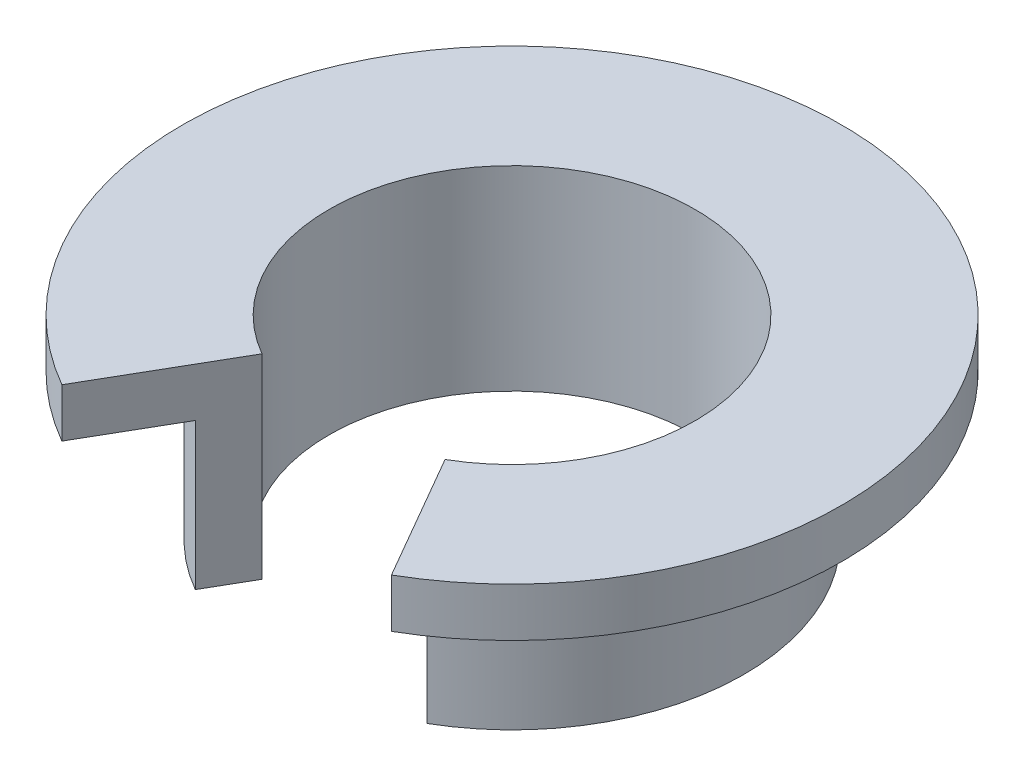
ISO-10303-21;
HEADER;
FILE_DESCRIPTION(('STEP AP214'),'2;1');
FILE_NAME('part.step','',(''),(''),'','','');
FILE_SCHEMA(('AUTOMOTIVE_DESIGN { 1 0 10303 214 1 1 1 1 }'));
ENDSEC;
DATA;
#1=APPLICATION_CONTEXT('core data for automotive mechanical design processes');
#2=APPLICATION_PROTOCOL_DEFINITION('international standard','automotive_design',2000,#1);
#3=PRODUCT_CONTEXT('',#1,'mechanical');
#4=PRODUCT('Part','Part','',(#3));
#5=PRODUCT_RELATED_PRODUCT_CATEGORY('part','',(#4));
#6=PRODUCT_DEFINITION_FORMATION('','',#4);
#7=PRODUCT_DEFINITION_CONTEXT('part definition',#1,'design');
#8=PRODUCT_DEFINITION('design','',#6,#7);
#9=PRODUCT_DEFINITION_SHAPE('','',#8);
#10=(LENGTH_UNIT() NAMED_UNIT(*) SI_UNIT(.MILLI.,.METRE.));
#11=(NAMED_UNIT(*) PLANE_ANGLE_UNIT() SI_UNIT($,.RADIAN.));
#12=(NAMED_UNIT(*) SI_UNIT($,.STERADIAN.) SOLID_ANGLE_UNIT());
#13=UNCERTAINTY_MEASURE_WITH_UNIT(LENGTH_MEASURE(1.E-05),#10,'distance_accuracy_value','');
#14=(GEOMETRIC_REPRESENTATION_CONTEXT(3) GLOBAL_UNCERTAINTY_ASSIGNED_CONTEXT((#13)) GLOBAL_UNIT_ASSIGNED_CONTEXT((#10,
#11,#12)) REPRESENTATION_CONTEXT('',''));
#15=CARTESIAN_POINT('',(0.,0.,0.));
#16=DIRECTION('',(0.,0.,1.));
#17=DIRECTION('',(1.,0.,0.));
#18=AXIS2_PLACEMENT_3D('',#15,#16,#17);
#19=CARTESIAN_POINT('',(4.75,0.,0.));
#20=DIRECTION('',(0.,-1.,0.));
#21=DIRECTION('',(0.,0.,-1.));
#22=AXIS2_PLACEMENT_3D('',#19,#20,#21);
#23=PLANE('',#22);
#24=CARTESIAN_POINT('',(0.,0.,0.));
#25=DIRECTION('',(0.,-1.,0.));
#26=DIRECTION('',(0.,0.,-1.));
#27=AXIS2_PLACEMENT_3D('',#24,#25,#26);
#28=CIRCLE('',#27,4.75);
#29=CARTESIAN_POINT('',(-2.37499999999997,0.,4.1136206679761));
#30=VERTEX_POINT('',#29);
#31=CARTESIAN_POINT('',(2.37500000000001,0.,4.11362066797608));
#32=VERTEX_POINT('',#31);
#33=EDGE_CURVE('E90',#30,#32,#28,.T.);
#34=ORIENTED_EDGE('',*,*,#33,.T.);
#35=DIRECTION('',(-0.500000000000001,0.,-0.866025403784438));
#36=VECTOR('',#35,1.);
#37=CARTESIAN_POINT('',(0.,0.,0.));
#38=LINE('',#37,#36);
#39=CARTESIAN_POINT('',(1.875,0.,3.24759526419164));
#40=VERTEX_POINT('',#39);
#41=EDGE_CURVE('E47',#32,#40,#38,.T.);
#42=ORIENTED_EDGE('',*,*,#41,.T.);
#43=CARTESIAN_POINT('',(0.,0.,0.));
#44=DIRECTION('',(0.,-1.,0.));
#45=DIRECTION('',(0.,0.,-1.));
#46=AXIS2_PLACEMENT_3D('',#43,#44,#45);
#47=CIRCLE('',#46,3.75);
#48=CARTESIAN_POINT('',(-1.87499999999998,0.,3.24759526419166));
#49=VERTEX_POINT('',#48);
#50=EDGE_CURVE('E96',#49,#40,#47,.T.);
#51=ORIENTED_EDGE('',*,*,#50,.F.);
#52=DIRECTION('',(-0.499999999999995,0.,0.866025403784442));
#53=VECTOR('',#52,1.);
#54=CARTESIAN_POINT('',(-4.54558343328374,0.,7.87318145649093));
#55=LINE('',#54,#53);
#56=EDGE_CURVE('E98',#49,#30,#55,.T.);
#57=ORIENTED_EDGE('',*,*,#56,.T.);
#58=EDGE_LOOP('',(#34,#42,#51,#57));
#59=FACE_BOUND('',#58,.T.);
#60=ADVANCED_FACE('F33',(#59),#23,.T.);
#61=CARTESIAN_POINT('',(0.,0.,0.));
#62=DIRECTION('',(0.,-1.,0.));
#63=DIRECTION('',(0.,0.,-1.));
#64=AXIS2_PLACEMENT_3D('',#61,#62,#63);
#65=CYLINDRICAL_SURFACE('',#64,3.75);
#66=ORIENTED_EDGE('',*,*,#50,.T.);
#67=DIRECTION('',(0.,-1.,0.));
#68=VECTOR('',#67,1.);
#69=CARTESIAN_POINT('',(1.875,0.,3.24759526419164));
#70=LINE('',#69,#68);
#71=CARTESIAN_POINT('',(1.875,4.,3.24759526419164));
#72=VERTEX_POINT('',#71);
#73=EDGE_CURVE('E82',#40,#72,#70,.F.);
#74=ORIENTED_EDGE('',*,*,#73,.T.);
#75=CARTESIAN_POINT('',(0.,4.,0.));
#76=DIRECTION('',(0.,-1.,0.));
#77=DIRECTION('',(0.,0.,-1.));
#78=AXIS2_PLACEMENT_3D('',#75,#76,#77);
#79=CIRCLE('',#78,3.75);
#80=CARTESIAN_POINT('',(-1.87499999999998,4.,3.24759526419166));
#81=VERTEX_POINT('',#80);
#82=EDGE_CURVE('E103',#81,#72,#79,.T.);
#83=ORIENTED_EDGE('',*,*,#82,.F.);
#84=DIRECTION('',(0.,-1.,0.));
#85=VECTOR('',#84,1.);
#86=CARTESIAN_POINT('',(-1.87499999999998,0.,3.24759526419166));
#87=LINE('',#86,#85);
#88=EDGE_CURVE('E102',#81,#49,#87,.T.);
#89=ORIENTED_EDGE('',*,*,#88,.T.);
#90=EDGE_LOOP('',(#66,#74,#83,#89));
#91=FACE_BOUND('',#90,.T.);
#92=ADVANCED_FACE('F101',(#91),#65,.F.);
#93=CARTESIAN_POINT('',(3.75,4.,0.));
#94=DIRECTION('',(0.,1.,0.));
#95=DIRECTION('',(0.,0.,1.));
#96=AXIS2_PLACEMENT_3D('',#93,#94,#95);
#97=PLANE('',#96);
#98=ORIENTED_EDGE('',*,*,#82,.T.);
#99=DIRECTION('',(0.500000000000001,0.,0.866025403784438));
#100=VECTOR('',#99,1.);
#101=CARTESIAN_POINT('',(0.937500000000005,4.,1.62379763209583));
#102=LINE('',#101,#100);
#103=CARTESIAN_POINT('',(3.37500000000001,4.,5.84567147554495));
#104=VERTEX_POINT('',#103);
#105=EDGE_CURVE('E85',#72,#104,#102,.T.);
#106=ORIENTED_EDGE('',*,*,#105,.T.);
#107=CARTESIAN_POINT('',(0.,4.,0.));
#108=DIRECTION('',(0.,-1.,0.));
#109=DIRECTION('',(0.,0.,-1.));
#110=AXIS2_PLACEMENT_3D('',#107,#108,#109);
#111=CIRCLE('',#110,6.75);
#112=CARTESIAN_POINT('',(-3.37499999999996,4.,5.84567147554498));
#113=VERTEX_POINT('',#112);
#114=EDGE_CURVE('E105',#113,#104,#111,.T.);
#115=ORIENTED_EDGE('',*,*,#114,.F.);
#116=DIRECTION('',(0.499999999999995,0.,-0.866025403784442));
#117=VECTOR('',#116,1.);
#118=CARTESIAN_POINT('',(0.93749999999998,4.,-1.62379763209581));
#119=LINE('',#118,#117);
#120=EDGE_CURVE('E125',#113,#81,#119,.T.);
#121=ORIENTED_EDGE('',*,*,#120,.T.);
#122=EDGE_LOOP('',(#98,#106,#115,#121));
#123=FACE_BOUND('',#122,.T.);
#124=ADVANCED_FACE('F142',(#123),#97,.T.);
#125=CARTESIAN_POINT('',(0.,0.,0.));
#126=DIRECTION('',(0.,-1.,0.));
#127=DIRECTION('',(0.,0.,-1.));
#128=AXIS2_PLACEMENT_3D('',#125,#126,#127);
#129=CYLINDRICAL_SURFACE('',#128,6.75);
#130=ORIENTED_EDGE('',*,*,#114,.T.);
#131=DIRECTION('',(0.,-1.,0.));
#132=VECTOR('',#131,1.);
#133=CARTESIAN_POINT('',(3.37500000000001,0.,5.84567147554495));
#134=LINE('',#133,#132);
#135=CARTESIAN_POINT('',(3.37500000000001,3.,5.84567147554496));
#136=VERTEX_POINT('',#135);
#137=EDGE_CURVE('E118',#104,#136,#134,.T.);
#138=ORIENTED_EDGE('',*,*,#137,.T.);
#139=CARTESIAN_POINT('',(0.,3.,0.));
#140=DIRECTION('',(0.,-1.,0.));
#141=DIRECTION('',(0.,0.,-1.));
#142=AXIS2_PLACEMENT_3D('',#139,#140,#141);
#143=CIRCLE('',#142,6.75);
#144=CARTESIAN_POINT('',(-3.37499999999996,3.,5.84567147554498));
#145=VERTEX_POINT('',#144);
#146=EDGE_CURVE('E110',#145,#136,#143,.T.);
#147=ORIENTED_EDGE('',*,*,#146,.F.);
#148=DIRECTION('',(0.,-1.,0.));
#149=VECTOR('',#148,1.);
#150=CARTESIAN_POINT('',(-3.37499999999996,0.,5.84567147554498));
#151=LINE('',#150,#149);
#152=EDGE_CURVE('E128',#145,#113,#151,.F.);
#153=ORIENTED_EDGE('',*,*,#152,.T.);
#154=EDGE_LOOP('',(#130,#138,#147,#153));
#155=FACE_BOUND('',#154,.T.);
#156=ADVANCED_FACE('F139',(#155),#129,.T.);
#157=CARTESIAN_POINT('',(6.75,3.,0.));
#158=DIRECTION('',(0.,-1.,0.));
#159=DIRECTION('',(0.,0.,-1.));
#160=AXIS2_PLACEMENT_3D('',#157,#158,#159);
#161=PLANE('',#160);
#162=ORIENTED_EDGE('',*,*,#146,.T.);
#163=DIRECTION('',(-0.500000000000001,0.,-0.866025403784438));
#164=VECTOR('',#163,1.);
#165=CARTESIAN_POINT('',(1.68750000000001,3.,2.92283573777249));
#166=LINE('',#165,#164);
#167=CARTESIAN_POINT('',(2.37500000000001,3.,4.11362066797608));
#168=VERTEX_POINT('',#167);
#169=EDGE_CURVE('E121',#136,#168,#166,.T.);
#170=ORIENTED_EDGE('',*,*,#169,.T.);
#171=CARTESIAN_POINT('',(0.,3.,0.));
#172=DIRECTION('',(0.,-1.,0.));
#173=DIRECTION('',(0.,0.,-1.));
#174=AXIS2_PLACEMENT_3D('',#171,#172,#173);
#175=CIRCLE('',#174,4.75);
#176=CARTESIAN_POINT('',(-2.37499999999997,3.,4.1136206679761));
#177=VERTEX_POINT('',#176);
#178=EDGE_CURVE('E113',#177,#168,#175,.T.);
#179=ORIENTED_EDGE('',*,*,#178,.F.);
#180=DIRECTION('',(-0.499999999999995,0.,0.866025403784442));
#181=VECTOR('',#180,1.);
#182=CARTESIAN_POINT('',(1.68749999999996,3.,-2.92283573777246));
#183=LINE('',#182,#181);
#184=EDGE_CURVE('E54',#177,#145,#183,.T.);
#185=ORIENTED_EDGE('',*,*,#184,.T.);
#186=EDGE_LOOP('',(#162,#170,#179,#185));
#187=FACE_BOUND('',#186,.T.);
#188=ADVANCED_FACE('F136',(#187),#161,.T.);
#189=CARTESIAN_POINT('',(0.,0.,0.));
#190=DIRECTION('',(0.,-1.,0.));
#191=DIRECTION('',(0.,0.,-1.));
#192=AXIS2_PLACEMENT_3D('',#189,#190,#191);
#193=CYLINDRICAL_SURFACE('',#192,4.75);
#194=ORIENTED_EDGE('',*,*,#178,.T.);
#195=DIRECTION('',(0.,-1.,0.));
#196=VECTOR('',#195,1.);
#197=CARTESIAN_POINT('',(2.37500000000001,0.,4.11362066797608));
#198=LINE('',#197,#196);
#199=EDGE_CURVE('E11',#168,#32,#198,.T.);
#200=ORIENTED_EDGE('',*,*,#199,.T.);
#201=ORIENTED_EDGE('',*,*,#33,.F.);
#202=DIRECTION('',(0.,-1.,0.));
#203=VECTOR('',#202,1.);
#204=CARTESIAN_POINT('',(-2.37499999999997,0.,4.1136206679761));
#205=LINE('',#204,#203);
#206=EDGE_CURVE('E40',#30,#177,#205,.F.);
#207=ORIENTED_EDGE('',*,*,#206,.T.);
#208=EDGE_LOOP('',(#194,#200,#201,#207));
#209=FACE_BOUND('',#208,.T.);
#210=ADVANCED_FACE('F133',(#209),#193,.T.);
#211=CARTESIAN_POINT('',(-4.54558343328374,5.,7.87318145649093));
#212=DIRECTION('',(0.866025403784442,0.,0.499999999999995));
#213=DIRECTION('',(0.499999999999995,0.,-0.866025403784442));
#214=AXIS2_PLACEMENT_3D('',#211,#212,#213);
#215=PLANE('',#214);
#216=ORIENTED_EDGE('',*,*,#120,.F.);
#217=ORIENTED_EDGE('',*,*,#152,.F.);
#218=ORIENTED_EDGE('',*,*,#184,.F.);
#219=ORIENTED_EDGE('',*,*,#206,.F.);
#220=ORIENTED_EDGE('',*,*,#56,.F.);
#221=ORIENTED_EDGE('',*,*,#88,.F.);
#222=EDGE_LOOP('',(#216,#217,#218,#219,#220,#221));
#223=FACE_BOUND('',#222,.T.);
#224=ADVANCED_FACE('F143',(#223),#215,.T.);
#225=CARTESIAN_POINT('',(0.,5.,0.));
#226=DIRECTION('',(-0.866025403784438,0.,0.500000000000001));
#227=DIRECTION('',(0.500000000000001,0.,0.866025403784438));
#228=AXIS2_PLACEMENT_3D('',#225,#226,#227);
#229=PLANE('',#228);
#230=ORIENTED_EDGE('',*,*,#41,.F.);
#231=ORIENTED_EDGE('',*,*,#199,.F.);
#232=ORIENTED_EDGE('',*,*,#169,.F.);
#233=ORIENTED_EDGE('',*,*,#137,.F.);
#234=ORIENTED_EDGE('',*,*,#105,.F.);
#235=ORIENTED_EDGE('',*,*,#73,.F.);
#236=EDGE_LOOP('',(#230,#231,#232,#233,#234,#235));
#237=FACE_BOUND('',#236,.T.);
#238=ADVANCED_FACE('F83',(#237),#229,.T.);
#239=CLOSED_SHELL('',(#60,#92,#124,#156,#188,#210,#224,#238));
#240=MANIFOLD_SOLID_BREP('B2',#239);
#241=ADVANCED_BREP_SHAPE_REPRESENTATION('',(#18,#240),#14);
#242=SHAPE_DEFINITION_REPRESENTATION(#9,#241);
ENDSEC;
END-ISO-10303-21;
